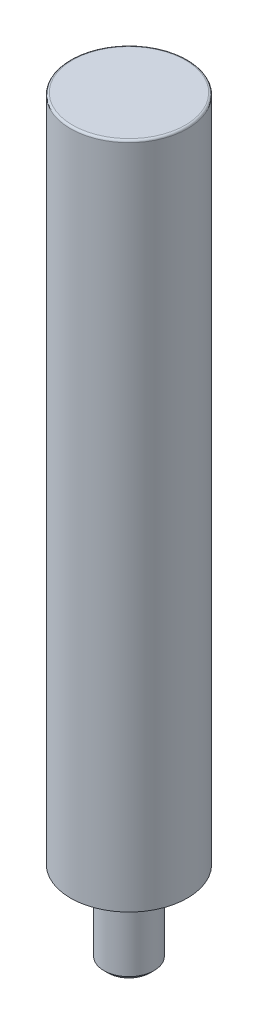
ISO-10303-21;
HEADER;
FILE_DESCRIPTION(('STEP AP214'),'2;1');
FILE_NAME('part.step','',(''),(''),'','','');
FILE_SCHEMA(('AUTOMOTIVE_DESIGN { 1 0 10303 214 1 1 1 1 }'));
ENDSEC;
DATA;
#1=APPLICATION_CONTEXT('core data for automotive mechanical design processes');
#2=APPLICATION_PROTOCOL_DEFINITION('international standard','automotive_design',2000,#1);
#3=PRODUCT_CONTEXT('',#1,'mechanical');
#4=PRODUCT('Part','Part','',(#3));
#5=PRODUCT_RELATED_PRODUCT_CATEGORY('part','',(#4));
#6=PRODUCT_DEFINITION_FORMATION('','',#4);
#7=PRODUCT_DEFINITION_CONTEXT('part definition',#1,'design');
#8=PRODUCT_DEFINITION('design','',#6,#7);
#9=PRODUCT_DEFINITION_SHAPE('','',#8);
#10=(LENGTH_UNIT() NAMED_UNIT(*) SI_UNIT(.MILLI.,.METRE.));
#11=(NAMED_UNIT(*) PLANE_ANGLE_UNIT() SI_UNIT($,.RADIAN.));
#12=(NAMED_UNIT(*) SI_UNIT($,.STERADIAN.) SOLID_ANGLE_UNIT());
#13=UNCERTAINTY_MEASURE_WITH_UNIT(LENGTH_MEASURE(1.E-05),#10,'distance_accuracy_value','');
#14=(GEOMETRIC_REPRESENTATION_CONTEXT(3) GLOBAL_UNCERTAINTY_ASSIGNED_CONTEXT((#13)) GLOBAL_UNIT_ASSIGNED_CONTEXT((#10,
#11,#12)) REPRESENTATION_CONTEXT('',''));
#15=CARTESIAN_POINT('',(0.,0.,0.));
#16=DIRECTION('',(0.,0.,1.));
#17=DIRECTION('',(1.,0.,0.));
#18=AXIS2_PLACEMENT_3D('',#15,#16,#17);
#19=CARTESIAN_POINT('',(0.,160.,0.));
#20=DIRECTION('',(0.,-1.,0.));
#21=DIRECTION('',(0.,0.,-1.));
#22=AXIS2_PLACEMENT_3D('',#19,#20,#21);
#23=CYLINDRICAL_SURFACE('',#22,14.);
#24=CARTESIAN_POINT('',(0.,159.5,0.));
#25=DIRECTION('',(0.,1.,0.));
#26=DIRECTION('',(0.,0.,1.));
#27=AXIS2_PLACEMENT_3D('',#24,#25,#26);
#28=CIRCLE('',#27,14.);
#29=CARTESIAN_POINT('',(0.,159.5,14.));
#30=VERTEX_POINT('',#29);
#31=EDGE_CURVE('E10',#30,#30,#28,.F.);
#32=ORIENTED_EDGE('',*,*,#31,.T.);
#33=EDGE_LOOP('',(#32));
#34=FACE_BOUND('',#33,.T.);
#35=CARTESIAN_POINT('',(0.,0.,0.));
#36=DIRECTION('',(0.,1.,0.));
#37=DIRECTION('',(0.,0.,1.));
#38=AXIS2_PLACEMENT_3D('',#35,#36,#37);
#39=CIRCLE('',#38,14.);
#40=CARTESIAN_POINT('',(0.,0.,14.));
#41=VERTEX_POINT('',#40);
#42=EDGE_CURVE('E54',#41,#41,#39,.T.);
#43=ORIENTED_EDGE('',*,*,#42,.T.);
#44=EDGE_LOOP('',(#43));
#45=FACE_BOUND('',#44,.T.);
#46=ADVANCED_FACE('F41',(#34,#45),#23,.T.);
#47=CARTESIAN_POINT('',(0.,160.,0.));
#48=DIRECTION('',(0.,1.,0.));
#49=DIRECTION('',(0.,0.,1.));
#50=AXIS2_PLACEMENT_3D('',#47,#48,#49);
#51=PLANE('',#50);
#52=CARTESIAN_POINT('',(0.,160.,0.));
#53=DIRECTION('',(0.,1.,0.));
#54=DIRECTION('',(0.,0.,1.));
#55=AXIS2_PLACEMENT_3D('',#52,#53,#54);
#56=CIRCLE('',#55,13.5);
#57=CARTESIAN_POINT('',(0.,160.,13.5));
#58=VERTEX_POINT('',#57);
#59=EDGE_CURVE('E49',#58,#58,#56,.T.);
#60=ORIENTED_EDGE('',*,*,#59,.T.);
#61=EDGE_LOOP('',(#60));
#62=FACE_BOUND('',#61,.T.);
#63=ADVANCED_FACE('F92',(#62),#51,.T.);
#64=CARTESIAN_POINT('',(0.,0.,0.));
#65=DIRECTION('',(0.,1.,0.));
#66=DIRECTION('',(0.,0.,1.));
#67=AXIS2_PLACEMENT_3D('',#64,#65,#66);
#68=PLANE('',#67);
#69=ORIENTED_EDGE('',*,*,#42,.F.);
#70=EDGE_LOOP('',(#69));
#71=FACE_BOUND('',#70,.T.);
#72=CARTESIAN_POINT('',(0.,0.,0.));
#73=DIRECTION('',(0.,1.,0.));
#74=DIRECTION('',(0.,0.,1.));
#75=AXIS2_PLACEMENT_3D('',#72,#73,#74);
#76=CIRCLE('',#75,6.);
#77=CARTESIAN_POINT('',(0.,0.,6.));
#78=VERTEX_POINT('',#77);
#79=EDGE_CURVE('E59',#78,#78,#76,.T.);
#80=ORIENTED_EDGE('',*,*,#79,.T.);
#81=EDGE_LOOP('',(#80));
#82=FACE_BOUND('',#81,.T.);
#83=ADVANCED_FACE('F96',(#71,#82),#68,.F.);
#84=CARTESIAN_POINT('',(0.,-20.,0.));
#85=DIRECTION('',(0.,1.,0.));
#86=DIRECTION('',(0.,0.,1.));
#87=AXIS2_PLACEMENT_3D('',#84,#85,#86);
#88=CYLINDRICAL_SURFACE('',#87,6.);
#89=ORIENTED_EDGE('',*,*,#79,.F.);
#90=EDGE_LOOP('',(#89));
#91=FACE_BOUND('',#90,.T.);
#92=CARTESIAN_POINT('',(0.,-19.036,0.));
#93=DIRECTION('',(0.,1.,0.));
#94=DIRECTION('',(0.,0.,1.));
#95=AXIS2_PLACEMENT_3D('',#92,#93,#94);
#96=CIRCLE('',#95,6.);
#97=CARTESIAN_POINT('',(0.,-19.036,6.));
#98=VERTEX_POINT('',#97);
#99=EDGE_CURVE('E69',#98,#98,#96,.T.);
#100=ORIENTED_EDGE('',*,*,#99,.T.);
#101=EDGE_LOOP('',(#100));
#102=FACE_BOUND('',#101,.T.);
#103=ADVANCED_FACE('F74',(#91,#102),#88,.T.);
#104=CARTESIAN_POINT('',(0.,-20.,0.));
#105=DIRECTION('',(0.,1.,0.));
#106=DIRECTION('',(0.,0.,1.));
#107=AXIS2_PLACEMENT_3D('',#104,#105,#106);
#108=CONICAL_SURFACE('',#107,5.036,0.785398163397449);
#109=ORIENTED_EDGE('',*,*,#99,.F.);
#110=EDGE_LOOP('',(#109));
#111=FACE_BOUND('',#110,.T.);
#112=CARTESIAN_POINT('',(0.,-20.,0.));
#113=DIRECTION('',(0.,1.,0.));
#114=DIRECTION('',(0.,0.,1.));
#115=AXIS2_PLACEMENT_3D('',#112,#113,#114);
#116=CIRCLE('',#115,5.036);
#117=CARTESIAN_POINT('',(0.,-20.,5.036));
#118=VERTEX_POINT('',#117);
#119=EDGE_CURVE('E65',#118,#118,#116,.T.);
#120=ORIENTED_EDGE('',*,*,#119,.T.);
#121=EDGE_LOOP('',(#120));
#122=FACE_BOUND('',#121,.T.);
#123=ADVANCED_FACE('F76',(#111,#122),#108,.T.);
#124=CARTESIAN_POINT('',(0.,-20.,0.));
#125=DIRECTION('',(0.,-1.,0.));
#126=DIRECTION('',(0.,0.,-1.));
#127=AXIS2_PLACEMENT_3D('',#124,#125,#126);
#128=PLANE('',#127);
#129=ORIENTED_EDGE('',*,*,#119,.F.);
#130=EDGE_LOOP('',(#129));
#131=FACE_BOUND('',#130,.T.);
#132=ADVANCED_FACE('F79',(#131),#128,.T.);
#133=CARTESIAN_POINT('',(0.,159.5,0.));
#134=DIRECTION('',(0.,1.,0.));
#135=DIRECTION('',(0.,0.,1.));
#136=AXIS2_PLACEMENT_3D('',#133,#134,#135);
#137=TOROIDAL_SURFACE('',#136,13.5,0.5);
#138=ORIENTED_EDGE('',*,*,#31,.F.);
#139=EDGE_LOOP('',(#138));
#140=FACE_BOUND('',#139,.T.);
#141=ORIENTED_EDGE('',*,*,#59,.F.);
#142=EDGE_LOOP('',(#141));
#143=FACE_BOUND('',#142,.T.);
#144=ADVANCED_FACE('F43',(#140,#143),#137,.T.);
#145=CLOSED_SHELL('',(#46,#63,#83,#103,#123,#132,#144));
#146=MANIFOLD_SOLID_BREP('B2',#145);
#147=ADVANCED_BREP_SHAPE_REPRESENTATION('',(#18,#146),#14);
#148=SHAPE_DEFINITION_REPRESENTATION(#9,#147);
ENDSEC;
END-ISO-10303-21;
